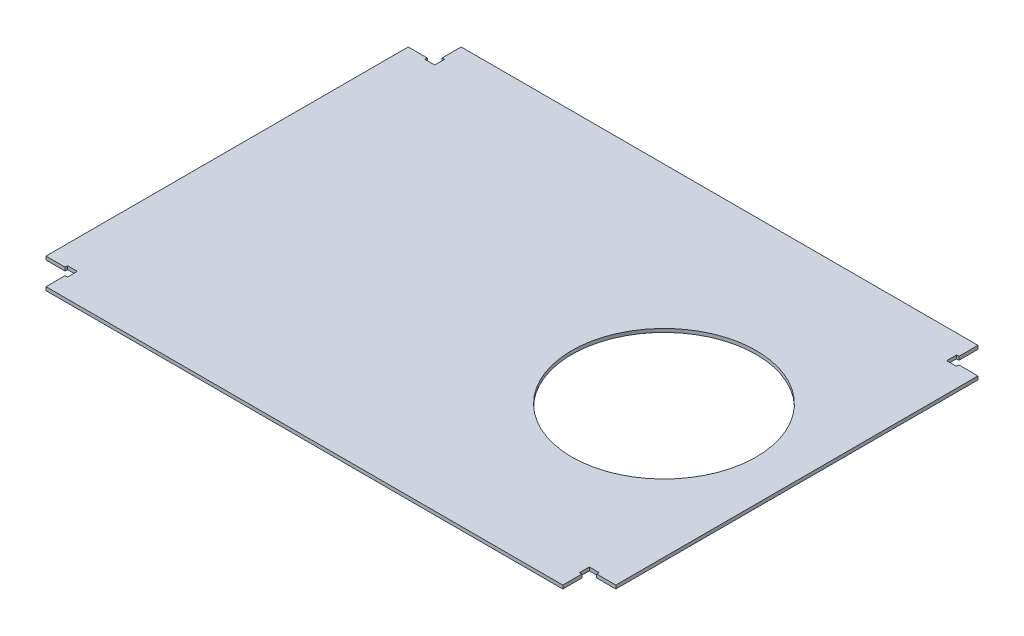
ISO-10303-21;
HEADER;
FILE_DESCRIPTION(('STEP AP214'),'2;1');
FILE_NAME('part.step','',(''),(''),'','','');
FILE_SCHEMA(('AUTOMOTIVE_DESIGN { 1 0 10303 214 1 1 1 1 }'));
ENDSEC;
DATA;
#1=APPLICATION_CONTEXT('core data for automotive mechanical design processes');
#2=APPLICATION_PROTOCOL_DEFINITION('international standard','automotive_design',2000,#1);
#3=PRODUCT_CONTEXT('',#1,'mechanical');
#4=PRODUCT('Part','Part','',(#3));
#5=PRODUCT_RELATED_PRODUCT_CATEGORY('part','',(#4));
#6=PRODUCT_DEFINITION_FORMATION('','',#4);
#7=PRODUCT_DEFINITION_CONTEXT('part definition',#1,'design');
#8=PRODUCT_DEFINITION('design','',#6,#7);
#9=PRODUCT_DEFINITION_SHAPE('','',#8);
#10=(LENGTH_UNIT() NAMED_UNIT(*) SI_UNIT(.MILLI.,.METRE.));
#11=(NAMED_UNIT(*) PLANE_ANGLE_UNIT() SI_UNIT($,.RADIAN.));
#12=(NAMED_UNIT(*) SI_UNIT($,.STERADIAN.) SOLID_ANGLE_UNIT());
#13=UNCERTAINTY_MEASURE_WITH_UNIT(LENGTH_MEASURE(1.E-05),#10,'distance_accuracy_value','');
#14=(GEOMETRIC_REPRESENTATION_CONTEXT(3) GLOBAL_UNCERTAINTY_ASSIGNED_CONTEXT((#13)) GLOBAL_UNIT_ASSIGNED_CONTEXT((#10,
#11,#12)) REPRESENTATION_CONTEXT('',''));
#15=CARTESIAN_POINT('',(0.,0.,0.));
#16=DIRECTION('',(0.,0.,1.));
#17=DIRECTION('',(1.,0.,0.));
#18=AXIS2_PLACEMENT_3D('',#15,#16,#17);
#19=CARTESIAN_POINT('',(0.,38.1,0.));
#20=DIRECTION('',(0.,-1.,0.));
#21=DIRECTION('',(0.,0.,-1.));
#22=AXIS2_PLACEMENT_3D('',#19,#20,#21);
#23=PLANE('',#22);
#24=CARTESIAN_POINT('',(209.2325,38.1,-255.525));
#25=DIRECTION('',(0.,1.,0.));
#26=DIRECTION('',(0.,0.,1.));
#27=AXIS2_PLACEMENT_3D('',#24,#25,#26);
#28=CIRCLE('',#27,127.);
#29=CARTESIAN_POINT('',(209.2325,38.1,-128.525));
#30=VERTEX_POINT('',#29);
#31=EDGE_CURVE('E468',#30,#30,#28,.T.);
#32=ORIENTED_EDGE('',*,*,#31,.F.);
#33=EDGE_LOOP('',(#32));
#34=FACE_BOUND('',#33,.T.);
#35=DIRECTION('',(1.,0.,0.));
#36=VECTOR('',#35,1.);
#37=CARTESIAN_POINT('',(358.03568812977,38.1,-501.525));
#38=LINE('',#37,#36);
#39=CARTESIAN_POINT('',(366.018577759541,38.1000000000001,-501.525));
#40=VERTEX_POINT('',#39);
#41=CARTESIAN_POINT('',(352.425,38.1,-501.525));
#42=VERTEX_POINT('',#41);
#43=EDGE_CURVE('E299',#40,#42,#38,.F.);
#44=ORIENTED_EDGE('',*,*,#43,.T.);
#45=DIRECTION('',(0.,0.,1.));
#46=VECTOR('',#45,1.);
#47=CARTESIAN_POINT('',(352.425,38.1,-507.135688129771));
#48=LINE('',#47,#46);
#49=CARTESIAN_POINT('',(352.425,38.1000000000001,-515.118577759541));
#50=VERTEX_POINT('',#49);
#51=EDGE_CURVE('E409',#42,#50,#48,.F.);
#52=ORIENTED_EDGE('',*,*,#51,.T.);
#53=DIRECTION('',(1.,0.,0.));
#54=VECTOR('',#53,1.);
#55=CARTESIAN_POINT('',(-361.95,38.1000000000001,-515.118577759541));
#56=LINE('',#55,#54);
#57=CARTESIAN_POINT('',(355.773286437627,38.1000000000001,-515.118577759541));
#58=VERTEX_POINT('',#57);
#59=EDGE_CURVE('E381',#50,#58,#56,.T.);
#60=ORIENTED_EDGE('',*,*,#59,.T.);
#61=DIRECTION('',(0.,0.,-1.));
#62=VECTOR('',#61,1.);
#63=CARTESIAN_POINT('',(355.773286437627,38.1000000000001,-503.221376259541));
#64=LINE('',#63,#62);
#65=CARTESIAN_POINT('',(355.773286437627,38.1000000000001,-541.321376259541));
#66=VERTEX_POINT('',#65);
#67=EDGE_CURVE('E378',#58,#66,#64,.T.);
#68=ORIENTED_EDGE('',*,*,#67,.T.);
#69=DIRECTION('',(-1.,0.,0.));
#70=VECTOR('',#69,1.);
#71=CARTESIAN_POINT('',(-361.95,38.1000000000001,-541.321376259541));
#72=LINE('',#71,#70);
#73=CARTESIAN_POINT('',(-355.773286437627,38.1000000000001,-541.321376259541));
#74=VERTEX_POINT('',#73);
#75=EDGE_CURVE('E375',#66,#74,#72,.T.);
#76=ORIENTED_EDGE('',*,*,#75,.T.);
#77=DIRECTION('',(0.,0.,1.));
#78=VECTOR('',#77,1.);
#79=CARTESIAN_POINT('',(-355.773286437627,38.1000000000001,-503.221376259541));
#80=LINE('',#79,#78);
#81=CARTESIAN_POINT('',(-355.773286437627,38.1000000000001,-515.118577759541));
#82=VERTEX_POINT('',#81);
#83=EDGE_CURVE('E372',#74,#82,#80,.T.);
#84=ORIENTED_EDGE('',*,*,#83,.T.);
#85=DIRECTION('',(1.,0.,0.));
#86=VECTOR('',#85,1.);
#87=CARTESIAN_POINT('',(-361.95,38.1000000000001,-515.118577759541));
#88=LINE('',#87,#86);
#89=CARTESIAN_POINT('',(-352.425,38.1000000000001,-515.118577759541));
#90=VERTEX_POINT('',#89);
#91=EDGE_CURVE('E369',#82,#90,#88,.T.);
#92=ORIENTED_EDGE('',*,*,#91,.T.);
#93=DIRECTION('',(0.,0.,1.));
#94=VECTOR('',#93,1.);
#95=CARTESIAN_POINT('',(-352.425,38.1,-507.135688129771));
#96=LINE('',#95,#94);
#97=CARTESIAN_POINT('',(-352.425,38.1,-501.525));
#98=VERTEX_POINT('',#97);
#99=EDGE_CURVE('E411',#90,#98,#96,.T.);
#100=ORIENTED_EDGE('',*,*,#99,.T.);
#101=DIRECTION('',(1.,0.,0.));
#102=VECTOR('',#101,1.);
#103=CARTESIAN_POINT('',(-358.035688129771,38.1,-501.525));
#104=LINE('',#103,#102);
#105=CARTESIAN_POINT('',(-366.018577759541,38.1000000000001,-501.525));
#106=VERTEX_POINT('',#105);
#107=EDGE_CURVE('E463',#98,#106,#104,.F.);
#108=ORIENTED_EDGE('',*,*,#107,.T.);
#109=DIRECTION('',(0.,0.,-1.));
#110=VECTOR('',#109,1.);
#111=CARTESIAN_POINT('',(-366.018577759541,38.1000000000001,0.));
#112=LINE('',#111,#110);
#113=CARTESIAN_POINT('',(-366.018577759541,38.1000000000001,-504.873286437627));
#114=VERTEX_POINT('',#113);
#115=EDGE_CURVE('E435',#106,#114,#112,.T.);
#116=ORIENTED_EDGE('',*,*,#115,.T.);
#117=DIRECTION('',(-1.,0.,0.));
#118=VECTOR('',#117,1.);
#119=CARTESIAN_POINT('',(-354.121376259541,38.1000000000001,-504.873286437627));
#120=LINE('',#119,#118);
#121=CARTESIAN_POINT('',(-392.221376259541,38.1000000000001,-504.873286437627));
#122=VERTEX_POINT('',#121);
#123=EDGE_CURVE('E432',#114,#122,#120,.T.);
#124=ORIENTED_EDGE('',*,*,#123,.T.);
#125=DIRECTION('',(0.,0.,1.));
#126=VECTOR('',#125,1.);
#127=CARTESIAN_POINT('',(-392.221376259541,38.1000000000001,0.));
#128=LINE('',#127,#126);
#129=CARTESIAN_POINT('',(-392.221376259541,38.1000000000001,-6.17671356237303));
#130=VERTEX_POINT('',#129);
#131=EDGE_CURVE('E429',#122,#130,#128,.T.);
#132=ORIENTED_EDGE('',*,*,#131,.T.);
#133=DIRECTION('',(1.,0.,0.));
#134=VECTOR('',#133,1.);
#135=CARTESIAN_POINT('',(-354.121376259541,38.1000000000001,-6.17671356237304));
#136=LINE('',#135,#134);
#137=CARTESIAN_POINT('',(-366.018577759541,38.1000000000001,-6.17671356237304));
#138=VERTEX_POINT('',#137);
#139=EDGE_CURVE('E426',#130,#138,#136,.T.);
#140=ORIENTED_EDGE('',*,*,#139,.T.);
#141=DIRECTION('',(0.,0.,1.));
#142=VECTOR('',#141,1.);
#143=CARTESIAN_POINT('',(-366.018577759541,38.1000000000001,0.));
#144=LINE('',#143,#142);
#145=CARTESIAN_POINT('',(-366.018577759541,38.1000000000001,-9.52499999999988));
#146=VERTEX_POINT('',#145);
#147=EDGE_CURVE('E458',#146,#138,#144,.T.);
#148=ORIENTED_EDGE('',*,*,#147,.F.);
#149=DIRECTION('',(1.,0.,0.));
#150=VECTOR('',#149,1.);
#151=CARTESIAN_POINT('',(-358.035688129771,38.1,-9.5249999999999));
#152=LINE('',#151,#150);
#153=CARTESIAN_POINT('',(-352.425,38.1,-9.5249999999999));
#154=VERTEX_POINT('',#153);
#155=EDGE_CURVE('E465',#146,#154,#152,.T.);
#156=ORIENTED_EDGE('',*,*,#155,.T.);
#157=DIRECTION('',(0.,0.,1.));
#158=VECTOR('',#157,1.);
#159=CARTESIAN_POINT('',(-352.425,38.1,-3.91431187022953));
#160=LINE('',#159,#158);
#161=CARTESIAN_POINT('',(-352.425,38.1000000000001,4.06857775954115));
#162=VERTEX_POINT('',#161);
#163=EDGE_CURVE('E359',#154,#162,#160,.T.);
#164=ORIENTED_EDGE('',*,*,#163,.T.);
#165=DIRECTION('',(1.,0.,0.));
#166=VECTOR('',#165,1.);
#167=CARTESIAN_POINT('',(-361.95,38.1000000000001,4.06857775954114));
#168=LINE('',#167,#166);
#169=CARTESIAN_POINT('',(-355.773286437627,38.1000000000001,4.06857775954114));
#170=VERTEX_POINT('',#169);
#171=EDGE_CURVE('E334',#170,#162,#168,.T.);
#172=ORIENTED_EDGE('',*,*,#171,.F.);
#173=DIRECTION('',(0.,0.,1.));
#174=VECTOR('',#173,1.);
#175=CARTESIAN_POINT('',(-355.773286437627,38.1000000000001,-7.82862374045885));
#176=LINE('',#175,#174);
#177=CARTESIAN_POINT('',(-355.773286437627,38.1000000000001,30.2713762595412));
#178=VERTEX_POINT('',#177);
#179=EDGE_CURVE('E331',#170,#178,#176,.T.);
#180=ORIENTED_EDGE('',*,*,#179,.T.);
#181=DIRECTION('',(1.,0.,0.));
#182=VECTOR('',#181,1.);
#183=CARTESIAN_POINT('',(-361.95,38.1000000000001,30.2713762595411));
#184=LINE('',#183,#182);
#185=CARTESIAN_POINT('',(355.773286437627,38.1000000000001,30.271376259541));
#186=VERTEX_POINT('',#185);
#187=EDGE_CURVE('E328',#178,#186,#184,.T.);
#188=ORIENTED_EDGE('',*,*,#187,.T.);
#189=DIRECTION('',(0.,0.,-1.));
#190=VECTOR('',#189,1.);
#191=CARTESIAN_POINT('',(355.773286437627,38.1000000000001,-7.82862374045896));
#192=LINE('',#191,#190);
#193=CARTESIAN_POINT('',(355.773286437627,38.1000000000001,4.06857775954103));
#194=VERTEX_POINT('',#193);
#195=EDGE_CURVE('E325',#186,#194,#192,.T.);
#196=ORIENTED_EDGE('',*,*,#195,.T.);
#197=DIRECTION('',(1.,0.,0.));
#198=VECTOR('',#197,1.);
#199=CARTESIAN_POINT('',(-361.95,38.1000000000001,4.06857775954114));
#200=LINE('',#199,#198);
#201=CARTESIAN_POINT('',(352.425,38.1000000000001,4.06857775954103));
#202=VERTEX_POINT('',#201);
#203=EDGE_CURVE('E354',#202,#194,#200,.T.);
#204=ORIENTED_EDGE('',*,*,#203,.F.);
#205=DIRECTION('',(0.,0.,1.));
#206=VECTOR('',#205,1.);
#207=CARTESIAN_POINT('',(352.425,38.1,-3.91431187022953));
#208=LINE('',#207,#206);
#209=CARTESIAN_POINT('',(352.425,38.1,-9.52500000000004));
#210=VERTEX_POINT('',#209);
#211=EDGE_CURVE('E361',#202,#210,#208,.F.);
#212=ORIENTED_EDGE('',*,*,#211,.T.);
#213=DIRECTION('',(1.,0.,0.));
#214=VECTOR('',#213,1.);
#215=CARTESIAN_POINT('',(358.03568812977,38.1,-9.52500000000003));
#216=LINE('',#215,#214);
#217=CARTESIAN_POINT('',(366.018577759541,38.1000000000001,-9.52500000000009));
#218=VERTEX_POINT('',#217);
#219=EDGE_CURVE('E292',#210,#218,#216,.T.);
#220=ORIENTED_EDGE('',*,*,#219,.T.);
#221=DIRECTION('',(0.,0.,-1.));
#222=VECTOR('',#221,1.);
#223=CARTESIAN_POINT('',(366.018577759541,38.1000000000001,-1.60095007531283E-13));
#224=LINE('',#223,#222);
#225=CARTESIAN_POINT('',(366.018577759541,38.1000000000001,-6.17671356237325));
#226=VERTEX_POINT('',#225);
#227=EDGE_CURVE('E493',#226,#218,#224,.T.);
#228=ORIENTED_EDGE('',*,*,#227,.F.);
#229=DIRECTION('',(1.,0.,0.));
#230=VECTOR('',#229,1.);
#231=CARTESIAN_POINT('',(354.121376259541,38.1000000000001,-6.17671356237325));
#232=LINE('',#231,#230);
#233=CARTESIAN_POINT('',(392.221376259541,38.1000000000001,-6.17671356237326));
#234=VERTEX_POINT('',#233);
#235=EDGE_CURVE('E584',#226,#234,#232,.T.);
#236=ORIENTED_EDGE('',*,*,#235,.T.);
#237=DIRECTION('',(0.,0.,-1.));
#238=VECTOR('',#237,1.);
#239=CARTESIAN_POINT('',(392.221376259541,38.1000000000001,-1.74325978182058E-13));
#240=LINE('',#239,#238);
#241=CARTESIAN_POINT('',(392.221376259541,38.1000000000001,-504.873286437627));
#242=VERTEX_POINT('',#241);
#243=EDGE_CURVE('E579',#234,#242,#240,.T.);
#244=ORIENTED_EDGE('',*,*,#243,.T.);
#245=DIRECTION('',(-1.,0.,0.));
#246=VECTOR('',#245,1.);
#247=CARTESIAN_POINT('',(354.121376259541,38.1000000000001,-504.873286437627));
#248=LINE('',#247,#246);
#249=CARTESIAN_POINT('',(366.018577759541,38.1000000000001,-504.873286437627));
#250=VERTEX_POINT('',#249);
#251=EDGE_CURVE('E576',#242,#250,#248,.T.);
#252=ORIENTED_EDGE('',*,*,#251,.T.);
#253=DIRECTION('',(0.,0.,1.));
#254=VECTOR('',#253,1.);
#255=CARTESIAN_POINT('',(366.018577759541,38.1000000000001,-1.60095007531283E-13));
#256=LINE('',#255,#254);
#257=EDGE_CURVE('E573',#250,#40,#256,.T.);
#258=ORIENTED_EDGE('',*,*,#257,.T.);
#259=EDGE_LOOP('',(#44,#52,#60,#68,#76,#84,#92,#100,#108,#116,#124,#132,#140,#148,#156,#164,
#172,#180,#188,#196,#204,#212,#220,#228,#236,#244,#252,#258));
#260=FACE_BOUND('',#259,.T.);
#261=ADVANCED_FACE('F99',(#34,#260),#23,.F.);
#262=CARTESIAN_POINT('',(0.,33.3375,0.));
#263=DIRECTION('',(0.,-1.,0.));
#264=DIRECTION('',(0.,0.,-1.));
#265=AXIS2_PLACEMENT_3D('',#262,#263,#264);
#266=PLANE('',#265);
#267=CARTESIAN_POINT('',(209.2325,33.3375,-255.525));
#268=DIRECTION('',(0.,-1.,0.));
#269=DIRECTION('',(0.,0.,-1.));
#270=AXIS2_PLACEMENT_3D('',#267,#268,#269);
#271=CIRCLE('',#270,127.);
#272=CARTESIAN_POINT('',(209.2325,33.3375,-382.525));
#273=VERTEX_POINT('',#272);
#274=EDGE_CURVE('E473',#273,#273,#271,.T.);
#275=ORIENTED_EDGE('',*,*,#274,.F.);
#276=EDGE_LOOP('',(#275));
#277=FACE_BOUND('',#276,.T.);
#278=DIRECTION('',(0.,0.,1.));
#279=VECTOR('',#278,1.);
#280=CARTESIAN_POINT('',(-352.425,33.3375,-3.91431187022953));
#281=LINE('',#280,#279);
#282=CARTESIAN_POINT('',(-352.425,33.3375,-9.52499999999993));
#283=VERTEX_POINT('',#282);
#284=CARTESIAN_POINT('',(-352.425,33.3375000000001,4.06857775954114));
#285=VERTEX_POINT('',#284);
#286=EDGE_CURVE('E318',#283,#285,#281,.T.);
#287=ORIENTED_EDGE('',*,*,#286,.F.);
#288=DIRECTION('',(1.,0.,0.));
#289=VECTOR('',#288,1.);
#290=CARTESIAN_POINT('',(-358.035688129771,33.3375,-9.5249999999999));
#291=LINE('',#290,#289);
#292=CARTESIAN_POINT('',(-366.018577759541,33.3375000000001,-9.52499999999988));
#293=VERTEX_POINT('',#292);
#294=EDGE_CURVE('E466',#293,#283,#291,.T.);
#295=ORIENTED_EDGE('',*,*,#294,.F.);
#296=DIRECTION('',(0.,0.,-1.));
#297=VECTOR('',#296,1.);
#298=CARTESIAN_POINT('',(-366.018577759541,33.3375000000001,0.));
#299=LINE('',#298,#297);
#300=CARTESIAN_POINT('',(-366.018577759541,33.3375000000001,-6.17671356237304));
#301=VERTEX_POINT('',#300);
#302=EDGE_CURVE('E419',#293,#301,#299,.F.);
#303=ORIENTED_EDGE('',*,*,#302,.T.);
#304=DIRECTION('',(1.,0.,0.));
#305=VECTOR('',#304,1.);
#306=CARTESIAN_POINT('',(-354.121376259541,33.3375000000001,-6.17671356237304));
#307=LINE('',#306,#305);
#308=CARTESIAN_POINT('',(-392.221376259541,33.3375000000001,-6.17671356237303));
#309=VERTEX_POINT('',#308);
#310=EDGE_CURVE('E455',#309,#301,#307,.T.);
#311=ORIENTED_EDGE('',*,*,#310,.F.);
#312=DIRECTION('',(0.,0.,-1.));
#313=VECTOR('',#312,1.);
#314=CARTESIAN_POINT('',(-392.221376259541,33.3375000000001,0.));
#315=LINE('',#314,#313);
#316=CARTESIAN_POINT('',(-392.221376259541,33.3375000000001,-504.873286437627));
#317=VERTEX_POINT('',#316);
#318=EDGE_CURVE('E450',#317,#309,#315,.F.);
#319=ORIENTED_EDGE('',*,*,#318,.F.);
#320=DIRECTION('',(1.,0.,0.));
#321=VECTOR('',#320,1.);
#322=CARTESIAN_POINT('',(-354.121376259541,33.3375000000001,-504.873286437627));
#323=LINE('',#322,#321);
#324=CARTESIAN_POINT('',(-366.018577759541,33.3375000000001,-504.873286437627));
#325=VERTEX_POINT('',#324);
#326=EDGE_CURVE('E445',#325,#317,#323,.F.);
#327=ORIENTED_EDGE('',*,*,#326,.F.);
#328=DIRECTION('',(0.,0.,-1.));
#329=VECTOR('',#328,1.);
#330=CARTESIAN_POINT('',(-366.018577759541,33.3375000000001,0.));
#331=LINE('',#330,#329);
#332=CARTESIAN_POINT('',(-366.018577759541,33.3375000000001,-501.525));
#333=VERTEX_POINT('',#332);
#334=EDGE_CURVE('E440',#333,#325,#331,.T.);
#335=ORIENTED_EDGE('',*,*,#334,.F.);
#336=DIRECTION('',(1.,0.,0.));
#337=VECTOR('',#336,1.);
#338=CARTESIAN_POINT('',(-358.035688129771,33.3375,-501.525));
#339=LINE('',#338,#337);
#340=CARTESIAN_POINT('',(-352.425,33.3375,-501.525));
#341=VERTEX_POINT('',#340);
#342=EDGE_CURVE('E422',#341,#333,#339,.F.);
#343=ORIENTED_EDGE('',*,*,#342,.F.);
#344=DIRECTION('',(0.,0.,1.));
#345=VECTOR('',#344,1.);
#346=CARTESIAN_POINT('',(-352.425,33.3375,-507.135688129771));
#347=LINE('',#346,#345);
#348=CARTESIAN_POINT('',(-352.425,33.3375000000001,-515.118577759541));
#349=VERTEX_POINT('',#348);
#350=EDGE_CURVE('E412',#349,#341,#347,.T.);
#351=ORIENTED_EDGE('',*,*,#350,.F.);
#352=DIRECTION('',(1.,0.,0.));
#353=VECTOR('',#352,1.);
#354=CARTESIAN_POINT('',(-361.95,33.3375000000001,-515.118577759541));
#355=LINE('',#354,#353);
#356=CARTESIAN_POINT('',(-355.773286437627,33.3375000000001,-515.118577759541));
#357=VERTEX_POINT('',#356);
#358=EDGE_CURVE('E363',#357,#349,#355,.T.);
#359=ORIENTED_EDGE('',*,*,#358,.F.);
#360=DIRECTION('',(0.,0.,1.));
#361=VECTOR('',#360,1.);
#362=CARTESIAN_POINT('',(-355.773286437627,33.3375000000001,-503.221376259541));
#363=LINE('',#362,#361);
#364=CARTESIAN_POINT('',(-355.773286437627,33.3375000000001,-541.321376259541));
#365=VERTEX_POINT('',#364);
#366=EDGE_CURVE('E401',#365,#357,#363,.T.);
#367=ORIENTED_EDGE('',*,*,#366,.F.);
#368=DIRECTION('',(1.,0.,0.));
#369=VECTOR('',#368,1.);
#370=CARTESIAN_POINT('',(-361.95,33.3375000000001,-541.321376259541));
#371=LINE('',#370,#369);
#372=CARTESIAN_POINT('',(355.773286437627,33.3375000000001,-541.321376259541));
#373=VERTEX_POINT('',#372);
#374=EDGE_CURVE('E396',#373,#365,#371,.F.);
#375=ORIENTED_EDGE('',*,*,#374,.F.);
#376=DIRECTION('',(0.,0.,1.));
#377=VECTOR('',#376,1.);
#378=CARTESIAN_POINT('',(355.773286437627,33.3375000000001,-503.221376259541));
#379=LINE('',#378,#377);
#380=CARTESIAN_POINT('',(355.773286437627,33.3375000000001,-515.118577759541));
#381=VERTEX_POINT('',#380);
#382=EDGE_CURVE('E391',#381,#373,#379,.F.);
#383=ORIENTED_EDGE('',*,*,#382,.F.);
#384=DIRECTION('',(1.,0.,0.));
#385=VECTOR('',#384,1.);
#386=CARTESIAN_POINT('',(-361.95,33.3375000000001,-515.118577759541));
#387=LINE('',#386,#385);
#388=CARTESIAN_POINT('',(352.425,33.3375000000001,-515.118577759541));
#389=VERTEX_POINT('',#388);
#390=EDGE_CURVE('E386',#389,#381,#387,.T.);
#391=ORIENTED_EDGE('',*,*,#390,.F.);
#392=DIRECTION('',(0.,0.,1.));
#393=VECTOR('',#392,1.);
#394=CARTESIAN_POINT('',(352.425,33.3375,-507.135688129771));
#395=LINE('',#394,#393);
#396=CARTESIAN_POINT('',(352.425,33.3375,-501.525));
#397=VERTEX_POINT('',#396);
#398=EDGE_CURVE('E113',#397,#389,#395,.F.);
#399=ORIENTED_EDGE('',*,*,#398,.F.);
#400=DIRECTION('',(1.,0.,0.));
#401=VECTOR('',#400,1.);
#402=CARTESIAN_POINT('',(358.03568812977,33.3375,-501.525));
#403=LINE('',#402,#401);
#404=CARTESIAN_POINT('',(366.018577759541,33.3375000000001,-501.525));
#405=VERTEX_POINT('',#404);
#406=EDGE_CURVE('E283',#405,#397,#403,.F.);
#407=ORIENTED_EDGE('',*,*,#406,.F.);
#408=DIRECTION('',(0.,0.,1.));
#409=VECTOR('',#408,1.);
#410=CARTESIAN_POINT('',(366.018577759541,33.3375000000001,-1.60095007531283E-13));
#411=LINE('',#410,#409);
#412=CARTESIAN_POINT('',(366.018577759541,33.3375000000001,-504.873286437627));
#413=VERTEX_POINT('',#412);
#414=EDGE_CURVE('E289',#413,#405,#411,.T.);
#415=ORIENTED_EDGE('',*,*,#414,.F.);
#416=DIRECTION('',(-1.,0.,0.));
#417=VECTOR('',#416,1.);
#418=CARTESIAN_POINT('',(354.121376259541,33.3375000000001,-504.873286437627));
#419=LINE('',#418,#417);
#420=CARTESIAN_POINT('',(392.221376259541,33.3375000000001,-504.873286437627));
#421=VERTEX_POINT('',#420);
#422=EDGE_CURVE('E303',#421,#413,#419,.T.);
#423=ORIENTED_EDGE('',*,*,#422,.F.);
#424=DIRECTION('',(0.,0.,1.));
#425=VECTOR('',#424,1.);
#426=CARTESIAN_POINT('',(392.221376259541,33.3375000000001,-1.74325978182058E-13));
#427=LINE('',#426,#425);
#428=CARTESIAN_POINT('',(392.221376259541,33.3375000000001,-6.17671356237326));
#429=VERTEX_POINT('',#428);
#430=EDGE_CURVE('E596',#429,#421,#427,.F.);
#431=ORIENTED_EDGE('',*,*,#430,.F.);
#432=DIRECTION('',(-1.,0.,0.));
#433=VECTOR('',#432,1.);
#434=CARTESIAN_POINT('',(354.121376259541,33.3375000000001,-6.17671356237324));
#435=LINE('',#434,#433);
#436=CARTESIAN_POINT('',(366.018577759541,33.3375000000001,-6.17671356237325));
#437=VERTEX_POINT('',#436);
#438=EDGE_CURVE('E591',#437,#429,#435,.F.);
#439=ORIENTED_EDGE('',*,*,#438,.F.);
#440=DIRECTION('',(0.,0.,1.));
#441=VECTOR('',#440,1.);
#442=CARTESIAN_POINT('',(366.018577759541,33.3375000000001,-1.60095007531283E-13));
#443=LINE('',#442,#441);
#444=CARTESIAN_POINT('',(366.018577759541,33.3375000000001,-9.5250000000001));
#445=VERTEX_POINT('',#444);
#446=EDGE_CURVE('E313',#437,#445,#443,.F.);
#447=ORIENTED_EDGE('',*,*,#446,.T.);
#448=DIRECTION('',(1.,0.,0.));
#449=VECTOR('',#448,1.);
#450=CARTESIAN_POINT('',(358.03568812977,33.3375,-9.52500000000003));
#451=LINE('',#450,#449);
#452=CARTESIAN_POINT('',(352.425,33.3375,-9.52500000000007));
#453=VERTEX_POINT('',#452);
#454=EDGE_CURVE('E293',#453,#445,#451,.T.);
#455=ORIENTED_EDGE('',*,*,#454,.F.);
#456=DIRECTION('',(0.,0.,1.));
#457=VECTOR('',#456,1.);
#458=CARTESIAN_POINT('',(352.425,33.3375,-3.91431187022953));
#459=LINE('',#458,#457);
#460=CARTESIAN_POINT('',(352.425,33.3375000000001,4.06857775954103));
#461=VERTEX_POINT('',#460);
#462=EDGE_CURVE('E121',#461,#453,#459,.F.);
#463=ORIENTED_EDGE('',*,*,#462,.F.);
#464=DIRECTION('',(-1.,0.,0.));
#465=VECTOR('',#464,1.);
#466=CARTESIAN_POINT('',(-361.95,33.3375000000001,4.06857775954114));
#467=LINE('',#466,#465);
#468=CARTESIAN_POINT('',(355.773286437627,33.3375000000001,4.06857775954103));
#469=VERTEX_POINT('',#468);
#470=EDGE_CURVE('E319',#461,#469,#467,.F.);
#471=ORIENTED_EDGE('',*,*,#470,.T.);
#472=DIRECTION('',(0.,0.,-1.));
#473=VECTOR('',#472,1.);
#474=CARTESIAN_POINT('',(355.773286437627,33.3375000000001,-7.82862374045896));
#475=LINE('',#474,#473);
#476=CARTESIAN_POINT('',(355.773286437627,33.3375000000001,30.271376259541));
#477=VERTEX_POINT('',#476);
#478=EDGE_CURVE('E351',#477,#469,#475,.T.);
#479=ORIENTED_EDGE('',*,*,#478,.F.);
#480=DIRECTION('',(-1.,0.,0.));
#481=VECTOR('',#480,1.);
#482=CARTESIAN_POINT('',(-361.95,33.3375000000001,30.2713762595411));
#483=LINE('',#482,#481);
#484=CARTESIAN_POINT('',(-355.773286437627,33.3375000000001,30.2713762595411));
#485=VERTEX_POINT('',#484);
#486=EDGE_CURVE('E346',#485,#477,#483,.F.);
#487=ORIENTED_EDGE('',*,*,#486,.F.);
#488=DIRECTION('',(0.,0.,-1.));
#489=VECTOR('',#488,1.);
#490=CARTESIAN_POINT('',(-355.773286437627,33.3375000000001,-7.82862374045885));
#491=LINE('',#490,#489);
#492=CARTESIAN_POINT('',(-355.773286437627,33.3375000000001,4.06857775954114));
#493=VERTEX_POINT('',#492);
#494=EDGE_CURVE('E341',#493,#485,#491,.F.);
#495=ORIENTED_EDGE('',*,*,#494,.F.);
#496=DIRECTION('',(-1.,0.,0.));
#497=VECTOR('',#496,1.);
#498=CARTESIAN_POINT('',(-361.95,33.3375000000001,4.06857775954114));
#499=LINE('',#498,#497);
#500=EDGE_CURVE('E315',#493,#285,#499,.F.);
#501=ORIENTED_EDGE('',*,*,#500,.T.);
#502=EDGE_LOOP('',(#287,#295,#303,#311,#319,#327,#335,#343,#351,#359,#367,#375,#383,#391,#399,
#407,#415,#423,#431,#439,#447,#455,#463,#471,#479,#487,#495,#501));
#503=FACE_BOUND('',#502,.T.);
#504=ADVANCED_FACE('F286',(#277,#503),#266,.T.);
#505=CARTESIAN_POINT('',(209.2325,-50.038,-255.525));
#506=DIRECTION('',(0.,1.,0.));
#507=DIRECTION('',(0.,0.,1.));
#508=AXIS2_PLACEMENT_3D('',#505,#506,#507);
#509=CYLINDRICAL_SURFACE('',#508,127.);
#510=ORIENTED_EDGE('',*,*,#274,.T.);
#511=EDGE_LOOP('',(#510));
#512=FACE_BOUND('',#511,.T.);
#513=ORIENTED_EDGE('',*,*,#31,.T.);
#514=EDGE_LOOP('',(#513));
#515=FACE_BOUND('',#514,.T.);
#516=ADVANCED_FACE('F624',(#512,#515),#509,.F.);
#517=CARTESIAN_POINT('',(-358.035688129771,35.71875,-501.525));
#518=DIRECTION('',(0.,0.,1.));
#519=DIRECTION('',(1.,0.,0.));
#520=AXIS2_PLACEMENT_3D('',#517,#518,#519);
#521=PLANE('',#520);
#522=DIRECTION('',(0.,1.,0.));
#523=VECTOR('',#522,1.);
#524=CARTESIAN_POINT('',(-352.425,38.1,-501.525));
#525=LINE('',#524,#523);
#526=EDGE_CURVE('E476',#341,#98,#525,.T.);
#527=ORIENTED_EDGE('',*,*,#526,.F.);
#528=ORIENTED_EDGE('',*,*,#342,.T.);
#529=DIRECTION('',(0.,1.,0.));
#530=VECTOR('',#529,1.);
#531=CARTESIAN_POINT('',(-366.018577759541,38.1000000000001,-501.525));
#532=LINE('',#531,#530);
#533=EDGE_CURVE('E423',#333,#106,#532,.T.);
#534=ORIENTED_EDGE('',*,*,#533,.T.);
#535=ORIENTED_EDGE('',*,*,#107,.F.);
#536=EDGE_LOOP('',(#527,#528,#534,#535));
#537=FACE_BOUND('',#536,.T.);
#538=ADVANCED_FACE('F546',(#537),#521,.F.);
#539=CARTESIAN_POINT('',(-358.035688129771,35.71875,-9.5249999999999));
#540=DIRECTION('',(0.,0.,1.));
#541=DIRECTION('',(1.,0.,0.));
#542=AXIS2_PLACEMENT_3D('',#539,#540,#541);
#543=PLANE('',#542);
#544=ORIENTED_EDGE('',*,*,#294,.T.);
#545=DIRECTION('',(0.,1.,0.));
#546=VECTOR('',#545,1.);
#547=CARTESIAN_POINT('',(-352.425,38.1,-9.52499999999993));
#548=LINE('',#547,#546);
#549=EDGE_CURVE('E479',#283,#154,#548,.T.);
#550=ORIENTED_EDGE('',*,*,#549,.T.);
#551=ORIENTED_EDGE('',*,*,#155,.F.);
#552=DIRECTION('',(0.,1.,0.));
#553=VECTOR('',#552,1.);
#554=CARTESIAN_POINT('',(-366.018577759541,38.1000000000001,-9.52499999999988));
#555=LINE('',#554,#553);
#556=EDGE_CURVE('E415',#293,#146,#555,.T.);
#557=ORIENTED_EDGE('',*,*,#556,.F.);
#558=EDGE_LOOP('',(#544,#550,#551,#557));
#559=FACE_BOUND('',#558,.T.);
#560=ADVANCED_FACE('F524',(#559),#543,.T.);
#561=CARTESIAN_POINT('',(-366.018577759541,38.1000000000001,0.));
#562=DIRECTION('',(1.,0.,0.));
#563=DIRECTION('',(0.,0.,1.));
#564=AXIS2_PLACEMENT_3D('',#561,#562,#563);
#565=PLANE('',#564);
#566=DIRECTION('',(0.,1.,0.));
#567=VECTOR('',#566,1.);
#568=CARTESIAN_POINT('',(-366.018577759541,38.1000000000001,-6.17671356237304));
#569=LINE('',#568,#567);
#570=EDGE_CURVE('E453',#301,#138,#569,.T.);
#571=ORIENTED_EDGE('',*,*,#570,.F.);
#572=ORIENTED_EDGE('',*,*,#302,.F.);
#573=ORIENTED_EDGE('',*,*,#556,.T.);
#574=ORIENTED_EDGE('',*,*,#147,.T.);
#575=EDGE_LOOP('',(#571,#572,#573,#574));
#576=FACE_BOUND('',#575,.T.);
#577=ADVANCED_FACE('F527',(#576),#565,.T.);
#578=CARTESIAN_POINT('',(-354.121376259541,38.1000000000001,-6.17671356237304));
#579=DIRECTION('',(0.,0.,-1.));
#580=DIRECTION('',(1.,0.,0.));
#581=AXIS2_PLACEMENT_3D('',#578,#579,#580);
#582=PLANE('',#581);
#583=DIRECTION('',(0.,1.,0.));
#584=VECTOR('',#583,1.);
#585=CARTESIAN_POINT('',(-392.221376259541,38.1000000000001,-6.17671356237303));
#586=LINE('',#585,#584);
#587=EDGE_CURVE('E448',#309,#130,#586,.T.);
#588=ORIENTED_EDGE('',*,*,#587,.F.);
#589=ORIENTED_EDGE('',*,*,#310,.T.);
#590=ORIENTED_EDGE('',*,*,#570,.T.);
#591=ORIENTED_EDGE('',*,*,#139,.F.);
#592=EDGE_LOOP('',(#588,#589,#590,#591));
#593=FACE_BOUND('',#592,.T.);
#594=ADVANCED_FACE('F530',(#593),#582,.F.);
#595=CARTESIAN_POINT('',(-392.221376259541,38.1000000000001,0.));
#596=DIRECTION('',(1.,0.,0.));
#597=DIRECTION('',(0.,0.,1.));
#598=AXIS2_PLACEMENT_3D('',#595,#596,#597);
#599=PLANE('',#598);
#600=DIRECTION('',(0.,1.,0.));
#601=VECTOR('',#600,1.);
#602=CARTESIAN_POINT('',(-392.221376259541,38.1000000000001,-504.873286437627));
#603=LINE('',#602,#601);
#604=EDGE_CURVE('E443',#317,#122,#603,.T.);
#605=ORIENTED_EDGE('',*,*,#604,.F.);
#606=ORIENTED_EDGE('',*,*,#318,.T.);
#607=ORIENTED_EDGE('',*,*,#587,.T.);
#608=ORIENTED_EDGE('',*,*,#131,.F.);
#609=EDGE_LOOP('',(#605,#606,#607,#608));
#610=FACE_BOUND('',#609,.T.);
#611=ADVANCED_FACE('F534',(#610),#599,.F.);
#612=CARTESIAN_POINT('',(-354.121376259541,38.1000000000001,-504.873286437627));
#613=DIRECTION('',(0.,0.,1.));
#614=DIRECTION('',(-1.,0.,0.));
#615=AXIS2_PLACEMENT_3D('',#612,#613,#614);
#616=PLANE('',#615);
#617=DIRECTION('',(0.,1.,0.));
#618=VECTOR('',#617,1.);
#619=CARTESIAN_POINT('',(-366.018577759541,38.1000000000001,-504.873286437627));
#620=LINE('',#619,#618);
#621=EDGE_CURVE('E438',#325,#114,#620,.T.);
#622=ORIENTED_EDGE('',*,*,#621,.F.);
#623=ORIENTED_EDGE('',*,*,#326,.T.);
#624=ORIENTED_EDGE('',*,*,#604,.T.);
#625=ORIENTED_EDGE('',*,*,#123,.F.);
#626=EDGE_LOOP('',(#622,#623,#624,#625));
#627=FACE_BOUND('',#626,.T.);
#628=ADVANCED_FACE('F539',(#627),#616,.F.);
#629=CARTESIAN_POINT('',(-366.018577759541,38.1000000000001,0.));
#630=DIRECTION('',(-1.,0.,0.));
#631=DIRECTION('',(0.,0.,-1.));
#632=AXIS2_PLACEMENT_3D('',#629,#630,#631);
#633=PLANE('',#632);
#634=ORIENTED_EDGE('',*,*,#533,.F.);
#635=ORIENTED_EDGE('',*,*,#334,.T.);
#636=ORIENTED_EDGE('',*,*,#621,.T.);
#637=ORIENTED_EDGE('',*,*,#115,.F.);
#638=EDGE_LOOP('',(#634,#635,#636,#637));
#639=FACE_BOUND('',#638,.T.);
#640=ADVANCED_FACE('F543',(#639),#633,.F.);
#641=CARTESIAN_POINT('',(352.425,35.71875,-507.135688129771));
#642=DIRECTION('',(-1.,0.,0.));
#643=DIRECTION('',(0.,0.,1.));
#644=AXIS2_PLACEMENT_3D('',#641,#642,#643);
#645=PLANE('',#644);
#646=DIRECTION('',(0.,1.,0.));
#647=VECTOR('',#646,1.);
#648=CARTESIAN_POINT('',(352.425,38.1,-501.525));
#649=LINE('',#648,#647);
#650=EDGE_CURVE('E12',#397,#42,#649,.T.);
#651=ORIENTED_EDGE('',*,*,#650,.F.);
#652=ORIENTED_EDGE('',*,*,#398,.T.);
#653=DIRECTION('',(0.,1.,0.));
#654=VECTOR('',#653,1.);
#655=CARTESIAN_POINT('',(352.425,38.1000000000001,-515.118577759541));
#656=LINE('',#655,#654);
#657=EDGE_CURVE('E366',#389,#50,#656,.T.);
#658=ORIENTED_EDGE('',*,*,#657,.T.);
#659=ORIENTED_EDGE('',*,*,#51,.F.);
#660=EDGE_LOOP('',(#651,#652,#658,#659));
#661=FACE_BOUND('',#660,.T.);
#662=ADVANCED_FACE('F571',(#661),#645,.F.);
#663=CARTESIAN_POINT('',(-352.425,35.71875,-507.135688129771));
#664=DIRECTION('',(-1.,0.,0.));
#665=DIRECTION('',(0.,0.,1.));
#666=AXIS2_PLACEMENT_3D('',#663,#664,#665);
#667=PLANE('',#666);
#668=ORIENTED_EDGE('',*,*,#350,.T.);
#669=ORIENTED_EDGE('',*,*,#526,.T.);
#670=ORIENTED_EDGE('',*,*,#99,.F.);
#671=DIRECTION('',(0.,1.,0.));
#672=VECTOR('',#671,1.);
#673=CARTESIAN_POINT('',(-352.425,38.1000000000001,-515.118577759541));
#674=LINE('',#673,#672);
#675=EDGE_CURVE('E404',#349,#90,#674,.T.);
#676=ORIENTED_EDGE('',*,*,#675,.F.);
#677=EDGE_LOOP('',(#668,#669,#670,#676));
#678=FACE_BOUND('',#677,.T.);
#679=ADVANCED_FACE('F550',(#678),#667,.T.);
#680=CARTESIAN_POINT('',(-361.95,38.1000000000001,-515.118577759541));
#681=DIRECTION('',(0.,0.,-1.));
#682=DIRECTION('',(1.,0.,0.));
#683=AXIS2_PLACEMENT_3D('',#680,#681,#682);
#684=PLANE('',#683);
#685=DIRECTION('',(0.,1.,0.));
#686=VECTOR('',#685,1.);
#687=CARTESIAN_POINT('',(-355.773286437627,38.1000000000001,-515.118577759541));
#688=LINE('',#687,#686);
#689=EDGE_CURVE('E399',#357,#82,#688,.T.);
#690=ORIENTED_EDGE('',*,*,#689,.F.);
#691=ORIENTED_EDGE('',*,*,#358,.T.);
#692=ORIENTED_EDGE('',*,*,#675,.T.);
#693=ORIENTED_EDGE('',*,*,#91,.F.);
#694=EDGE_LOOP('',(#690,#691,#692,#693));
#695=FACE_BOUND('',#694,.T.);
#696=ADVANCED_FACE('F553',(#695),#684,.F.);
#697=CARTESIAN_POINT('',(-355.773286437627,38.1000000000001,-503.221376259541));
#698=DIRECTION('',(1.,0.,0.));
#699=DIRECTION('',(0.,0.,1.));
#700=AXIS2_PLACEMENT_3D('',#697,#698,#699);
#701=PLANE('',#700);
#702=DIRECTION('',(0.,1.,0.));
#703=VECTOR('',#702,1.);
#704=CARTESIAN_POINT('',(-355.773286437627,38.1000000000001,-541.321376259541));
#705=LINE('',#704,#703);
#706=EDGE_CURVE('E394',#365,#74,#705,.T.);
#707=ORIENTED_EDGE('',*,*,#706,.F.);
#708=ORIENTED_EDGE('',*,*,#366,.T.);
#709=ORIENTED_EDGE('',*,*,#689,.T.);
#710=ORIENTED_EDGE('',*,*,#83,.F.);
#711=EDGE_LOOP('',(#707,#708,#709,#710));
#712=FACE_BOUND('',#711,.T.);
#713=ADVANCED_FACE('F557',(#712),#701,.F.);
#714=CARTESIAN_POINT('',(-361.95,38.1000000000001,-541.321376259541));
#715=DIRECTION('',(0.,0.,1.));
#716=DIRECTION('',(-1.,0.,0.));
#717=AXIS2_PLACEMENT_3D('',#714,#715,#716);
#718=PLANE('',#717);
#719=DIRECTION('',(0.,1.,0.));
#720=VECTOR('',#719,1.);
#721=CARTESIAN_POINT('',(355.773286437627,38.1000000000001,-541.321376259541));
#722=LINE('',#721,#720);
#723=EDGE_CURVE('E389',#373,#66,#722,.T.);
#724=ORIENTED_EDGE('',*,*,#723,.F.);
#725=ORIENTED_EDGE('',*,*,#374,.T.);
#726=ORIENTED_EDGE('',*,*,#706,.T.);
#727=ORIENTED_EDGE('',*,*,#75,.F.);
#728=EDGE_LOOP('',(#724,#725,#726,#727));
#729=FACE_BOUND('',#728,.T.);
#730=ADVANCED_FACE('F561',(#729),#718,.F.);
#731=CARTESIAN_POINT('',(355.773286437627,38.1000000000001,-503.221376259541));
#732=DIRECTION('',(-1.,0.,0.));
#733=DIRECTION('',(0.,0.,-1.));
#734=AXIS2_PLACEMENT_3D('',#731,#732,#733);
#735=PLANE('',#734);
#736=DIRECTION('',(0.,1.,0.));
#737=VECTOR('',#736,1.);
#738=CARTESIAN_POINT('',(355.773286437627,38.1000000000001,-515.118577759541));
#739=LINE('',#738,#737);
#740=EDGE_CURVE('E384',#381,#58,#739,.T.);
#741=ORIENTED_EDGE('',*,*,#740,.F.);
#742=ORIENTED_EDGE('',*,*,#382,.T.);
#743=ORIENTED_EDGE('',*,*,#723,.T.);
#744=ORIENTED_EDGE('',*,*,#67,.F.);
#745=EDGE_LOOP('',(#741,#742,#743,#744));
#746=FACE_BOUND('',#745,.T.);
#747=ADVANCED_FACE('F565',(#746),#735,.F.);
#748=CARTESIAN_POINT('',(-361.95,38.1000000000001,-515.118577759541));
#749=DIRECTION('',(0.,0.,-1.));
#750=DIRECTION('',(1.,0.,0.));
#751=AXIS2_PLACEMENT_3D('',#748,#749,#750);
#752=PLANE('',#751);
#753=ORIENTED_EDGE('',*,*,#657,.F.);
#754=ORIENTED_EDGE('',*,*,#390,.T.);
#755=ORIENTED_EDGE('',*,*,#740,.T.);
#756=ORIENTED_EDGE('',*,*,#59,.F.);
#757=EDGE_LOOP('',(#753,#754,#755,#756));
#758=FACE_BOUND('',#757,.T.);
#759=ADVANCED_FACE('F569',(#758),#752,.F.);
#760=CARTESIAN_POINT('',(-352.425,35.71875,-3.91431187022953));
#761=DIRECTION('',(-1.,0.,0.));
#762=DIRECTION('',(0.,0.,1.));
#763=AXIS2_PLACEMENT_3D('',#760,#761,#762);
#764=PLANE('',#763);
#765=ORIENTED_EDGE('',*,*,#549,.F.);
#766=ORIENTED_EDGE('',*,*,#286,.T.);
#767=DIRECTION('',(0.,1.,0.));
#768=VECTOR('',#767,1.);
#769=CARTESIAN_POINT('',(-352.425,38.1000000000001,4.06857775954115));
#770=LINE('',#769,#768);
#771=EDGE_CURVE('E322',#285,#162,#770,.T.);
#772=ORIENTED_EDGE('',*,*,#771,.T.);
#773=ORIENTED_EDGE('',*,*,#163,.F.);
#774=EDGE_LOOP('',(#765,#766,#772,#773));
#775=FACE_BOUND('',#774,.T.);
#776=ADVANCED_FACE('F519',(#775),#764,.T.);
#777=CARTESIAN_POINT('',(352.425,35.71875,-3.91431187022953));
#778=DIRECTION('',(-1.,0.,0.));
#779=DIRECTION('',(0.,0.,1.));
#780=AXIS2_PLACEMENT_3D('',#777,#778,#779);
#781=PLANE('',#780);
#782=ORIENTED_EDGE('',*,*,#462,.T.);
#783=DIRECTION('',(0.,1.,0.));
#784=VECTOR('',#783,1.);
#785=CARTESIAN_POINT('',(352.425,38.1,-9.52500000000004));
#786=LINE('',#785,#784);
#787=EDGE_CURVE('E106',#453,#210,#786,.T.);
#788=ORIENTED_EDGE('',*,*,#787,.T.);
#789=ORIENTED_EDGE('',*,*,#211,.F.);
#790=DIRECTION('',(0.,1.,0.));
#791=VECTOR('',#790,1.);
#792=CARTESIAN_POINT('',(352.425,38.1000000000001,4.06857775954103));
#793=LINE('',#792,#791);
#794=EDGE_CURVE('E312',#461,#202,#793,.T.);
#795=ORIENTED_EDGE('',*,*,#794,.F.);
#796=EDGE_LOOP('',(#782,#788,#789,#795));
#797=FACE_BOUND('',#796,.T.);
#798=ADVANCED_FACE('F482',(#797),#781,.F.);
#799=CARTESIAN_POINT('',(-361.95,38.1000000000001,4.06857775954114));
#800=DIRECTION('',(0.,0.,-1.));
#801=DIRECTION('',(1.,0.,0.));
#802=AXIS2_PLACEMENT_3D('',#799,#800,#801);
#803=PLANE('',#802);
#804=DIRECTION('',(0.,1.,0.));
#805=VECTOR('',#804,1.);
#806=CARTESIAN_POINT('',(355.773286437627,38.1000000000001,4.06857775954103));
#807=LINE('',#806,#805);
#808=EDGE_CURVE('E349',#469,#194,#807,.T.);
#809=ORIENTED_EDGE('',*,*,#808,.F.);
#810=ORIENTED_EDGE('',*,*,#470,.F.);
#811=ORIENTED_EDGE('',*,*,#794,.T.);
#812=ORIENTED_EDGE('',*,*,#203,.T.);
#813=EDGE_LOOP('',(#809,#810,#811,#812));
#814=FACE_BOUND('',#813,.T.);
#815=ADVANCED_FACE('F498',(#814),#803,.T.);
#816=CARTESIAN_POINT('',(355.773286437627,38.1000000000001,-7.82862374045896));
#817=DIRECTION('',(-1.,0.,0.));
#818=DIRECTION('',(0.,0.,-1.));
#819=AXIS2_PLACEMENT_3D('',#816,#817,#818);
#820=PLANE('',#819);
#821=DIRECTION('',(0.,1.,0.));
#822=VECTOR('',#821,1.);
#823=CARTESIAN_POINT('',(355.773286437627,38.1000000000001,30.271376259541));
#824=LINE('',#823,#822);
#825=EDGE_CURVE('E344',#477,#186,#824,.T.);
#826=ORIENTED_EDGE('',*,*,#825,.F.);
#827=ORIENTED_EDGE('',*,*,#478,.T.);
#828=ORIENTED_EDGE('',*,*,#808,.T.);
#829=ORIENTED_EDGE('',*,*,#195,.F.);
#830=EDGE_LOOP('',(#826,#827,#828,#829));
#831=FACE_BOUND('',#830,.T.);
#832=ADVANCED_FACE('F503',(#831),#820,.F.);
#833=CARTESIAN_POINT('',(-361.95,38.1000000000001,30.2713762595411));
#834=DIRECTION('',(0.,0.,-1.));
#835=DIRECTION('',(1.,0.,0.));
#836=AXIS2_PLACEMENT_3D('',#833,#834,#835);
#837=PLANE('',#836);
#838=DIRECTION('',(0.,1.,0.));
#839=VECTOR('',#838,1.);
#840=CARTESIAN_POINT('',(-355.773286437627,38.1000000000001,30.2713762595412));
#841=LINE('',#840,#839);
#842=EDGE_CURVE('E339',#485,#178,#841,.T.);
#843=ORIENTED_EDGE('',*,*,#842,.F.);
#844=ORIENTED_EDGE('',*,*,#486,.T.);
#845=ORIENTED_EDGE('',*,*,#825,.T.);
#846=ORIENTED_EDGE('',*,*,#187,.F.);
#847=EDGE_LOOP('',(#843,#844,#845,#846));
#848=FACE_BOUND('',#847,.T.);
#849=ADVANCED_FACE('F506',(#848),#837,.F.);
#850=CARTESIAN_POINT('',(-355.773286437627,38.1000000000001,-7.82862374045885));
#851=DIRECTION('',(1.,0.,0.));
#852=DIRECTION('',(0.,0.,1.));
#853=AXIS2_PLACEMENT_3D('',#850,#851,#852);
#854=PLANE('',#853);
#855=DIRECTION('',(0.,1.,0.));
#856=VECTOR('',#855,1.);
#857=CARTESIAN_POINT('',(-355.773286437627,38.1000000000001,4.06857775954114));
#858=LINE('',#857,#856);
#859=EDGE_CURVE('E337',#493,#170,#858,.T.);
#860=ORIENTED_EDGE('',*,*,#859,.F.);
#861=ORIENTED_EDGE('',*,*,#494,.T.);
#862=ORIENTED_EDGE('',*,*,#842,.T.);
#863=ORIENTED_EDGE('',*,*,#179,.F.);
#864=EDGE_LOOP('',(#860,#861,#862,#863));
#865=FACE_BOUND('',#864,.T.);
#866=ADVANCED_FACE('F510',(#865),#854,.F.);
#867=CARTESIAN_POINT('',(-361.95,38.1000000000001,4.06857775954114));
#868=DIRECTION('',(0.,0.,-1.));
#869=DIRECTION('',(1.,0.,0.));
#870=AXIS2_PLACEMENT_3D('',#867,#868,#869);
#871=PLANE('',#870);
#872=ORIENTED_EDGE('',*,*,#771,.F.);
#873=ORIENTED_EDGE('',*,*,#500,.F.);
#874=ORIENTED_EDGE('',*,*,#859,.T.);
#875=ORIENTED_EDGE('',*,*,#171,.T.);
#876=EDGE_LOOP('',(#872,#873,#874,#875));
#877=FACE_BOUND('',#876,.T.);
#878=ADVANCED_FACE('F515',(#877),#871,.T.);
#879=CARTESIAN_POINT('',(358.03568812977,35.71875,-9.52500000000003));
#880=DIRECTION('',(0.,0.,1.));
#881=DIRECTION('',(1.,0.,0.));
#882=AXIS2_PLACEMENT_3D('',#879,#880,#881);
#883=PLANE('',#882);
#884=ORIENTED_EDGE('',*,*,#787,.F.);
#885=ORIENTED_EDGE('',*,*,#454,.T.);
#886=DIRECTION('',(0.,1.,0.));
#887=VECTOR('',#886,1.);
#888=CARTESIAN_POINT('',(366.018577759541,38.1000000000001,-9.52500000000009));
#889=LINE('',#888,#887);
#890=EDGE_CURVE('E488',#445,#218,#889,.T.);
#891=ORIENTED_EDGE('',*,*,#890,.T.);
#892=ORIENTED_EDGE('',*,*,#219,.F.);
#893=EDGE_LOOP('',(#884,#885,#891,#892));
#894=FACE_BOUND('',#893,.T.);
#895=ADVANCED_FACE('F486',(#894),#883,.T.);
#896=CARTESIAN_POINT('',(358.03568812977,35.71875,-501.525));
#897=DIRECTION('',(0.,0.,1.));
#898=DIRECTION('',(1.,0.,0.));
#899=AXIS2_PLACEMENT_3D('',#896,#897,#898);
#900=PLANE('',#899);
#901=ORIENTED_EDGE('',*,*,#406,.T.);
#902=ORIENTED_EDGE('',*,*,#650,.T.);
#903=ORIENTED_EDGE('',*,*,#43,.F.);
#904=DIRECTION('',(0.,1.,0.));
#905=VECTOR('',#904,1.);
#906=CARTESIAN_POINT('',(366.018577759541,38.1000000000001,-501.525));
#907=LINE('',#906,#905);
#908=EDGE_CURVE('E296',#405,#40,#907,.T.);
#909=ORIENTED_EDGE('',*,*,#908,.F.);
#910=EDGE_LOOP('',(#901,#902,#903,#909));
#911=FACE_BOUND('',#910,.T.);
#912=ADVANCED_FACE('F297',(#911),#900,.F.);
#913=CARTESIAN_POINT('',(366.018577759541,38.1000000000001,-1.60095007531283E-13));
#914=DIRECTION('',(1.,0.,0.));
#915=DIRECTION('',(0.,0.,1.));
#916=AXIS2_PLACEMENT_3D('',#913,#914,#915);
#917=PLANE('',#916);
#918=DIRECTION('',(0.,1.,0.));
#919=VECTOR('',#918,1.);
#920=CARTESIAN_POINT('',(366.018577759541,38.1000000000001,-504.873286437627));
#921=LINE('',#920,#919);
#922=EDGE_CURVE('E306',#413,#250,#921,.T.);
#923=ORIENTED_EDGE('',*,*,#922,.F.);
#924=ORIENTED_EDGE('',*,*,#414,.T.);
#925=ORIENTED_EDGE('',*,*,#908,.T.);
#926=ORIENTED_EDGE('',*,*,#257,.F.);
#927=EDGE_LOOP('',(#923,#924,#925,#926));
#928=FACE_BOUND('',#927,.T.);
#929=ADVANCED_FACE('F305',(#928),#917,.F.);
#930=CARTESIAN_POINT('',(354.121376259541,38.1000000000001,-504.873286437627));
#931=DIRECTION('',(0.,0.,1.));
#932=DIRECTION('',(-1.,0.,0.));
#933=AXIS2_PLACEMENT_3D('',#930,#931,#932);
#934=PLANE('',#933);
#935=DIRECTION('',(0.,1.,0.));
#936=VECTOR('',#935,1.);
#937=CARTESIAN_POINT('',(392.221376259541,38.1000000000001,-504.873286437627));
#938=LINE('',#937,#936);
#939=EDGE_CURVE('E594',#421,#242,#938,.T.);
#940=ORIENTED_EDGE('',*,*,#939,.F.);
#941=ORIENTED_EDGE('',*,*,#422,.T.);
#942=ORIENTED_EDGE('',*,*,#922,.T.);
#943=ORIENTED_EDGE('',*,*,#251,.F.);
#944=EDGE_LOOP('',(#940,#941,#942,#943));
#945=FACE_BOUND('',#944,.T.);
#946=ADVANCED_FACE('F600',(#945),#934,.F.);
#947=CARTESIAN_POINT('',(392.221376259541,38.1000000000001,-1.74325978182058E-13));
#948=DIRECTION('',(-1.,0.,0.));
#949=DIRECTION('',(0.,0.,-1.));
#950=AXIS2_PLACEMENT_3D('',#947,#948,#949);
#951=PLANE('',#950);
#952=DIRECTION('',(0.,1.,0.));
#953=VECTOR('',#952,1.);
#954=CARTESIAN_POINT('',(392.221376259541,38.1000000000001,-6.17671356237326));
#955=LINE('',#954,#953);
#956=EDGE_CURVE('E589',#429,#234,#955,.T.);
#957=ORIENTED_EDGE('',*,*,#956,.F.);
#958=ORIENTED_EDGE('',*,*,#430,.T.);
#959=ORIENTED_EDGE('',*,*,#939,.T.);
#960=ORIENTED_EDGE('',*,*,#243,.F.);
#961=EDGE_LOOP('',(#957,#958,#959,#960));
#962=FACE_BOUND('',#961,.T.);
#963=ADVANCED_FACE('F604',(#962),#951,.F.);
#964=CARTESIAN_POINT('',(354.121376259541,38.1000000000001,-6.17671356237325));
#965=DIRECTION('',(0.,0.,-1.));
#966=DIRECTION('',(1.,0.,0.));
#967=AXIS2_PLACEMENT_3D('',#964,#965,#966);
#968=PLANE('',#967);
#969=DIRECTION('',(0.,1.,0.));
#970=VECTOR('',#969,1.);
#971=CARTESIAN_POINT('',(366.018577759541,38.1000000000001,-6.17671356237325));
#972=LINE('',#971,#970);
#973=EDGE_CURVE('E587',#437,#226,#972,.T.);
#974=ORIENTED_EDGE('',*,*,#973,.F.);
#975=ORIENTED_EDGE('',*,*,#438,.T.);
#976=ORIENTED_EDGE('',*,*,#956,.T.);
#977=ORIENTED_EDGE('',*,*,#235,.F.);
#978=EDGE_LOOP('',(#974,#975,#976,#977));
#979=FACE_BOUND('',#978,.T.);
#980=ADVANCED_FACE('F607',(#979),#968,.F.);
#981=CARTESIAN_POINT('',(366.018577759541,38.1000000000001,-1.60095007531283E-13));
#982=DIRECTION('',(-1.,0.,0.));
#983=DIRECTION('',(0.,0.,-1.));
#984=AXIS2_PLACEMENT_3D('',#981,#982,#983);
#985=PLANE('',#984);
#986=ORIENTED_EDGE('',*,*,#890,.F.);
#987=ORIENTED_EDGE('',*,*,#446,.F.);
#988=ORIENTED_EDGE('',*,*,#973,.T.);
#989=ORIENTED_EDGE('',*,*,#227,.T.);
#990=EDGE_LOOP('',(#986,#987,#988,#989));
#991=FACE_BOUND('',#990,.T.);
#992=ADVANCED_FACE('F611',(#991),#985,.T.);
#993=CLOSED_SHELL('',(#261,#504,#516,#538,#560,#577,#594,#611,#628,#640,#662,#679,#696,#713,
#730,#747,#759,#776,#798,#815,#832,#849,#866,#878,#895,#912,#929,#946,#963,#980,#992));
#994=MANIFOLD_SOLID_BREP('B2',#993);
#995=ADVANCED_BREP_SHAPE_REPRESENTATION('',(#18,#994),#14);
#996=SHAPE_DEFINITION_REPRESENTATION(#9,#995);
ENDSEC;
END-ISO-10303-21;
